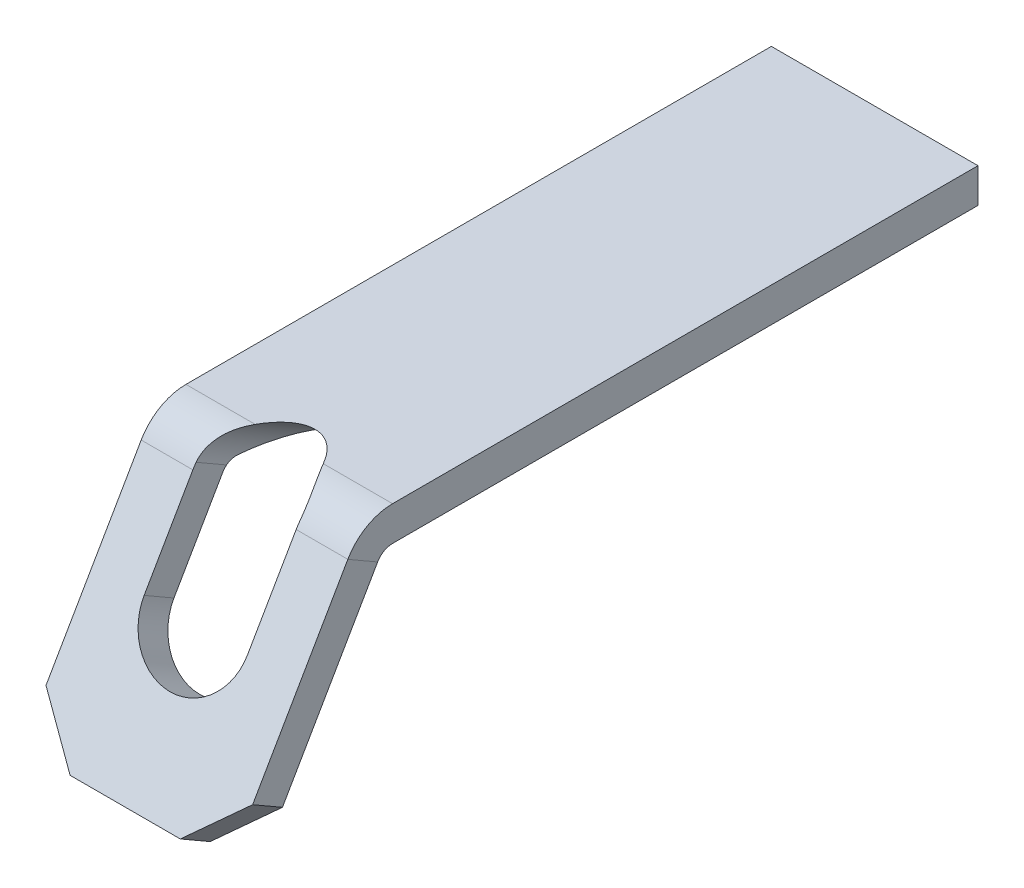
ISO-10303-21;
HEADER;
FILE_DESCRIPTION(('STEP AP214'),'2;1');
FILE_NAME('part.step','',(''),(''),'','','');
FILE_SCHEMA(('AUTOMOTIVE_DESIGN { 1 0 10303 214 1 1 1 1 }'));
ENDSEC;
DATA;
#1=APPLICATION_CONTEXT('core data for automotive mechanical design processes');
#2=APPLICATION_PROTOCOL_DEFINITION('international standard','automotive_design',2000,#1);
#3=PRODUCT_CONTEXT('',#1,'mechanical');
#4=PRODUCT('Part','Part','',(#3));
#5=PRODUCT_RELATED_PRODUCT_CATEGORY('part','',(#4));
#6=PRODUCT_DEFINITION_FORMATION('','',#4);
#7=PRODUCT_DEFINITION_CONTEXT('part definition',#1,'design');
#8=PRODUCT_DEFINITION('design','',#6,#7);
#9=PRODUCT_DEFINITION_SHAPE('','',#8);
#10=(LENGTH_UNIT() NAMED_UNIT(*) SI_UNIT(.MILLI.,.METRE.));
#11=(NAMED_UNIT(*) PLANE_ANGLE_UNIT() SI_UNIT($,.RADIAN.));
#12=(NAMED_UNIT(*) SI_UNIT($,.STERADIAN.) SOLID_ANGLE_UNIT());
#13=UNCERTAINTY_MEASURE_WITH_UNIT(LENGTH_MEASURE(1.E-05),#10,'distance_accuracy_value','');
#14=(GEOMETRIC_REPRESENTATION_CONTEXT(3) GLOBAL_UNCERTAINTY_ASSIGNED_CONTEXT((#13)) GLOBAL_UNIT_ASSIGNED_CONTEXT((#10,
#11,#12)) REPRESENTATION_CONTEXT('',''));
#15=CARTESIAN_POINT('',(0.,0.,0.));
#16=DIRECTION('',(0.,0.,1.));
#17=DIRECTION('',(1.,0.,0.));
#18=AXIS2_PLACEMENT_3D('',#15,#16,#17);
#19=CARTESIAN_POINT('',(0.,-0.5,4.25));
#20=DIRECTION('',(1.,0.,0.));
#21=DIRECTION('',(0.,0.,-1.));
#22=AXIS2_PLACEMENT_3D('',#19,#20,#21);
#23=CYLINDRICAL_SURFACE('',#22,0.25);
#24=CARTESIAN_POINT('',(0.738540154084688,-0.25,4.25));
#25=CARTESIAN_POINT('',(0.739796227190586,-0.249992222476748,4.26423192600012));
#26=CARTESIAN_POINT('',(0.741136393695474,-0.251215674942695,4.27845228618072));
#27=CARTESIAN_POINT('',(0.743704492818735,-0.255982139403662,4.30608304503192));
#28=CARTESIAN_POINT('',(0.74493454642555,-0.2594573169147,4.31950497559517));
#29=CARTESIAN_POINT('',(0.747172335123278,-0.268891956089954,4.34646595481917));
#30=CARTESIAN_POINT('',(0.748160348429003,-0.274998607282581,4.35995559261057));
#31=CARTESIAN_POINT('',(0.749588900459598,-0.289725386987503,4.38608332336731));
#32=CARTESIAN_POINT('',(0.750011148585141,-0.298418856822308,4.3986810266524));
#33=CARTESIAN_POINT('',(0.75,-0.308220009215909,4.41037591818866));
#34=B_SPLINE_CURVE_WITH_KNOTS('',3,(#24,#25,#26,#27,#28,#29,#30,#31,#32,#33),.UNSPECIFIED.,.F.,
.F.,(4,2,2,2,4),(0.,0.0428026914059938,0.0843723717900828,0.128652135829097,0.174331417159321),.UNSPECIFIED.);
#35=CARTESIAN_POINT('',(0.738540154084688,-0.25,4.25));
#36=VERTEX_POINT('',#35);
#37=CARTESIAN_POINT('',(0.75,-0.308220009215908,4.41037591818866));
#38=VERTEX_POINT('',#37);
#39=EDGE_CURVE('E319',#36,#38,#34,.T.);
#40=ORIENTED_EDGE('',*,*,#39,.F.);
#41=DIRECTION('',(1.,0.,0.));
#42=VECTOR('',#41,1.);
#43=CARTESIAN_POINT('',(-1.5,-0.25,4.25));
#44=LINE('',#43,#42);
#45=CARTESIAN_POINT('',(1.5,-0.25,4.25));
#46=VERTEX_POINT('',#45);
#47=EDGE_CURVE('E318',#36,#46,#44,.T.);
#48=ORIENTED_EDGE('',*,*,#47,.T.);
#49=CARTESIAN_POINT('',(1.5,-0.5,4.25));
#50=DIRECTION('',(1.,0.,0.));
#51=DIRECTION('',(0.,1.,0.));
#52=AXIS2_PLACEMENT_3D('',#49,#50,#51);
#53=CIRCLE('',#52,0.25);
#54=CARTESIAN_POINT('',(1.5,-0.375,4.46650635094611));
#55=VERTEX_POINT('',#54);
#56=EDGE_CURVE('E345',#46,#55,#53,.T.);
#57=ORIENTED_EDGE('',*,*,#56,.T.);
#58=DIRECTION('',(1.,0.,0.));
#59=VECTOR('',#58,1.);
#60=CARTESIAN_POINT('',(-1.5,-0.375,4.46650635094611));
#61=LINE('',#60,#59);
#62=CARTESIAN_POINT('',(0.75,-0.375,4.46650635094611));
#63=VERTEX_POINT('',#62);
#64=EDGE_CURVE('E334',#63,#55,#61,.T.);
#65=ORIENTED_EDGE('',*,*,#64,.F.);
#66=CARTESIAN_POINT('',(0.75,-0.5,4.25));
#67=DIRECTION('',(1.,0.,0.));
#68=DIRECTION('',(0.,0.,-1.));
#69=AXIS2_PLACEMENT_3D('',#66,#67,#68);
#70=CIRCLE('',#69,0.25);
#71=EDGE_CURVE('E205',#38,#63,#70,.T.);
#72=ORIENTED_EDGE('',*,*,#71,.F.);
#73=EDGE_LOOP('',(#40,#48,#57,#65,#72));
#74=FACE_BOUND('',#73,.T.);
#75=ADVANCED_FACE('F34',(#74),#23,.F.);
#76=CARTESIAN_POINT('',(0.,-0.5,4.25));
#77=DIRECTION('',(1.,0.,0.));
#78=DIRECTION('',(0.,0.,-1.));
#79=AXIS2_PLACEMENT_3D('',#76,#77,#78);
#80=CYLINDRICAL_SURFACE('',#79,0.75);
#81=CARTESIAN_POINT('',(0.75,-0.0530774463347981,4.85229580027208));
#82=CARTESIAN_POINT('',(0.750002475309161,-0.0390500007812527,4.84189012408484));
#83=CARTESIAN_POINT('',(0.749397484850658,-0.0253996458115997,4.83099771523583));
#84=CARTESIAN_POINT('',(0.747030547301498,0.00104006971930772,4.8083555069125));
#85=CARTESIAN_POINT('',(0.745269813605595,0.0138303177827564,4.79660661812892));
#86=CARTESIAN_POINT('',(0.738388136393959,0.0505308719127275,4.7604737016062));
#87=CARTESIAN_POINT('',(0.731665075692414,0.0730740166895009,4.73497676608455));
#88=CARTESIAN_POINT('',(0.714670479663492,0.113924752364809,4.68210224166803));
#89=CARTESIAN_POINT('',(0.704412929418581,0.132248568388786,4.65473240041221));
#90=CARTESIAN_POINT('',(0.681092480512217,0.164811508788652,4.59868326911695));
#91=CARTESIAN_POINT('',(0.668020265449992,0.179036692146175,4.56999988576025));
#92=CARTESIAN_POINT('',(0.63361768347433,0.2088635379017,4.49914580377907));
#93=CARTESIAN_POINT('',(0.611187373419911,0.222307050936848,4.45660414355653));
#94=CARTESIAN_POINT('',(0.564129396140941,0.241456718121171,4.37110856302409));
#95=CARTESIAN_POINT('',(0.539503361307708,0.247168570016325,4.3281549698181));
#96=CARTESIAN_POINT('',(0.508168812013807,0.249724148600028,4.27340370863223));
#97=CARTESIAN_POINT('',(0.501476538124168,0.249996949131605,4.26170462495713));
#98=CARTESIAN_POINT('',(0.494804752028709,0.250000000000006,4.25));
#99=B_SPLINE_CURVE_WITH_KNOTS('',3,(#81,#82,#83,#84,#85,#86,#87,#88,#89,#90,#91,#92,#93,#94,#95,
#96,#97,#98),.UNSPECIFIED.,.F.,.F.,(4,2,2,2,2,2,2,2,4),(0.,0.0523524240966635,0.104649972016483,
0.208128032232243,0.311201270134959,0.4146210689264,0.563636486235141,0.712542028697262,
0.752971410406567),.UNSPECIFIED.);
#100=CARTESIAN_POINT('',(0.75,-0.0530774463347985,4.85229580027207));
#101=VERTEX_POINT('',#100);
#102=CARTESIAN_POINT('',(0.494804752028707,0.25,4.25));
#103=VERTEX_POINT('',#102);
#104=EDGE_CURVE('E244',#101,#103,#99,.T.);
#105=ORIENTED_EDGE('',*,*,#104,.F.);
#106=CARTESIAN_POINT('',(0.75,-0.5,4.25));
#107=DIRECTION('',(1.,0.,0.));
#108=DIRECTION('',(0.,0.,-1.));
#109=AXIS2_PLACEMENT_3D('',#106,#107,#108);
#110=CIRCLE('',#109,0.75);
#111=CARTESIAN_POINT('',(0.75,-0.125000000000001,4.89951905283833));
#112=VERTEX_POINT('',#111);
#113=EDGE_CURVE('E207',#112,#101,#110,.F.);
#114=ORIENTED_EDGE('',*,*,#113,.F.);
#115=DIRECTION('',(-1.,0.,0.));
#116=VECTOR('',#115,1.);
#117=CARTESIAN_POINT('',(1.5,-0.125000000000001,4.89951905283833));
#118=LINE('',#117,#116);
#119=CARTESIAN_POINT('',(1.5,-0.125000000000001,4.89951905283833));
#120=VERTEX_POINT('',#119);
#121=EDGE_CURVE('E342',#120,#112,#118,.T.);
#122=ORIENTED_EDGE('',*,*,#121,.F.);
#123=CARTESIAN_POINT('',(1.5,-0.5,4.25));
#124=DIRECTION('',(1.,0.,0.));
#125=DIRECTION('',(0.,1.,0.));
#126=AXIS2_PLACEMENT_3D('',#123,#124,#125);
#127=CIRCLE('',#126,0.75);
#128=CARTESIAN_POINT('',(1.5,0.25,4.25));
#129=VERTEX_POINT('',#128);
#130=EDGE_CURVE('E356',#129,#120,#127,.T.);
#131=ORIENTED_EDGE('',*,*,#130,.F.);
#132=DIRECTION('',(1.,0.,0.));
#133=VECTOR('',#132,1.);
#134=CARTESIAN_POINT('',(-1.5,0.25,4.25));
#135=LINE('',#134,#133);
#136=EDGE_CURVE('E373',#103,#129,#135,.T.);
#137=ORIENTED_EDGE('',*,*,#136,.F.);
#138=EDGE_LOOP('',(#105,#114,#122,#131,#137));
#139=FACE_BOUND('',#138,.T.);
#140=ADVANCED_FACE('F258',(#139),#80,.T.);
#141=CARTESIAN_POINT('',(1.5,0.25,-4.25));
#142=DIRECTION('',(-1.,0.,0.));
#143=DIRECTION('',(0.,0.,1.));
#144=AXIS2_PLACEMENT_3D('',#141,#142,#143);
#145=PLANE('',#144);
#146=DIRECTION('',(0.,0.,-1.));
#147=VECTOR('',#146,1.);
#148=CARTESIAN_POINT('',(1.5,-0.25,-4.25));
#149=LINE('',#148,#147);
#150=CARTESIAN_POINT('',(1.5,-0.25,-4.25));
#151=VERTEX_POINT('',#150);
#152=EDGE_CURVE('E365',#46,#151,#149,.T.);
#153=ORIENTED_EDGE('',*,*,#152,.T.);
#154=DIRECTION('',(0.,-1.,0.));
#155=VECTOR('',#154,1.);
#156=CARTESIAN_POINT('',(1.5,0.25,-4.25));
#157=LINE('',#156,#155);
#158=CARTESIAN_POINT('',(1.5,0.25,-4.25));
#159=VERTEX_POINT('',#158);
#160=EDGE_CURVE('E183',#159,#151,#157,.T.);
#161=ORIENTED_EDGE('',*,*,#160,.F.);
#162=DIRECTION('',(0.,0.,-1.));
#163=VECTOR('',#162,1.);
#164=CARTESIAN_POINT('',(1.5,0.25,-4.25));
#165=LINE('',#164,#163);
#166=EDGE_CURVE('E366',#129,#159,#165,.T.);
#167=ORIENTED_EDGE('',*,*,#166,.F.);
#168=ORIENTED_EDGE('',*,*,#130,.T.);
#169=DIRECTION('',(0.,0.5,0.866025403784439));
#170=VECTOR('',#169,1.);
#171=CARTESIAN_POINT('',(1.5,-0.375,4.46650635094611));
#172=LINE('',#171,#170);
#173=EDGE_CURVE('E348',#55,#120,#172,.T.);
#174=ORIENTED_EDGE('',*,*,#173,.F.);
#175=ORIENTED_EDGE('',*,*,#56,.F.);
#176=EDGE_LOOP('',(#153,#161,#167,#168,#174,#175));
#177=FACE_BOUND('',#176,.T.);
#178=ADVANCED_FACE('F281',(#177),#145,.F.);
#179=CARTESIAN_POINT('',(-1.5,0.25,-4.25));
#180=DIRECTION('',(0.,0.,1.));
#181=DIRECTION('',(1.,0.,0.));
#182=AXIS2_PLACEMENT_3D('',#179,#180,#181);
#183=PLANE('',#182);
#184=DIRECTION('',(-1.,0.,0.));
#185=VECTOR('',#184,1.);
#186=CARTESIAN_POINT('',(-1.5,-0.25,-4.25));
#187=LINE('',#186,#185);
#188=CARTESIAN_POINT('',(-1.5,-0.25,-4.25));
#189=VERTEX_POINT('',#188);
#190=EDGE_CURVE('E380',#151,#189,#187,.T.);
#191=ORIENTED_EDGE('',*,*,#190,.T.);
#192=DIRECTION('',(0.,-1.,0.));
#193=VECTOR('',#192,1.);
#194=CARTESIAN_POINT('',(-1.5,0.25,-4.25));
#195=LINE('',#194,#193);
#196=CARTESIAN_POINT('',(-1.5,0.25,-4.25));
#197=VERTEX_POINT('',#196);
#198=EDGE_CURVE('E377',#197,#189,#195,.T.);
#199=ORIENTED_EDGE('',*,*,#198,.F.);
#200=DIRECTION('',(-1.,0.,0.));
#201=VECTOR('',#200,1.);
#202=CARTESIAN_POINT('',(-1.5,0.25,-4.25));
#203=LINE('',#202,#201);
#204=EDGE_CURVE('E369',#159,#197,#203,.T.);
#205=ORIENTED_EDGE('',*,*,#204,.F.);
#206=ORIENTED_EDGE('',*,*,#160,.T.);
#207=EDGE_LOOP('',(#191,#199,#205,#206));
#208=FACE_BOUND('',#207,.T.);
#209=ADVANCED_FACE('F277',(#208),#183,.F.);
#210=CARTESIAN_POINT('',(-1.5,0.25,-4.25));
#211=DIRECTION('',(1.,0.,0.));
#212=DIRECTION('',(0.,0.,-1.));
#213=AXIS2_PLACEMENT_3D('',#210,#211,#212);
#214=PLANE('',#213);
#215=DIRECTION('',(0.,0.,1.));
#216=VECTOR('',#215,1.);
#217=CARTESIAN_POINT('',(-1.5,-0.25,-4.25));
#218=LINE('',#217,#216);
#219=CARTESIAN_POINT('',(-1.5,-0.25,4.25));
#220=VERTEX_POINT('',#219);
#221=EDGE_CURVE('E382',#189,#220,#218,.T.);
#222=ORIENTED_EDGE('',*,*,#221,.T.);
#223=CARTESIAN_POINT('',(-1.5,-0.5,4.25));
#224=DIRECTION('',(1.,0.,0.));
#225=DIRECTION('',(0.,1.,0.));
#226=AXIS2_PLACEMENT_3D('',#223,#224,#225);
#227=CIRCLE('',#226,0.25);
#228=CARTESIAN_POINT('',(-1.5,-0.375,4.46650635094611));
#229=VERTEX_POINT('',#228);
#230=EDGE_CURVE('E332',#220,#229,#227,.T.);
#231=ORIENTED_EDGE('',*,*,#230,.T.);
#232=DIRECTION('',(0.,-0.5,-0.866025403784439));
#233=VECTOR('',#232,1.);
#234=CARTESIAN_POINT('',(-1.5,-0.125000000000001,4.89951905283833));
#235=LINE('',#234,#233);
#236=CARTESIAN_POINT('',(-1.5,-0.125000000000001,4.89951905283833));
#237=VERTEX_POINT('',#236);
#238=EDGE_CURVE('E323',#237,#229,#235,.T.);
#239=ORIENTED_EDGE('',*,*,#238,.F.);
#240=CARTESIAN_POINT('',(-1.5,-0.5,4.25));
#241=DIRECTION('',(1.,0.,0.));
#242=DIRECTION('',(0.,1.,0.));
#243=AXIS2_PLACEMENT_3D('',#240,#241,#242);
#244=CIRCLE('',#243,0.75);
#245=CARTESIAN_POINT('',(-1.5,0.25,4.25));
#246=VERTEX_POINT('',#245);
#247=EDGE_CURVE('E320',#246,#237,#244,.T.);
#248=ORIENTED_EDGE('',*,*,#247,.F.);
#249=DIRECTION('',(0.,0.,1.));
#250=VECTOR('',#249,1.);
#251=CARTESIAN_POINT('',(-1.5,0.25,-4.25));
#252=LINE('',#251,#250);
#253=EDGE_CURVE('E371',#197,#246,#252,.T.);
#254=ORIENTED_EDGE('',*,*,#253,.F.);
#255=ORIENTED_EDGE('',*,*,#198,.T.);
#256=EDGE_LOOP('',(#222,#231,#239,#248,#254,#255));
#257=FACE_BOUND('',#256,.T.);
#258=ADVANCED_FACE('F270',(#257),#214,.F.);
#259=CARTESIAN_POINT('',(0.,0.25,0.));
#260=DIRECTION('',(0.,1.,0.));
#261=DIRECTION('',(0.,0.,1.));
#262=AXIS2_PLACEMENT_3D('',#259,#260,#261);
#263=PLANE('',#262);
#264=CARTESIAN_POINT('',(0.,0.25,5.37724133595217));
#265=DIRECTION('',(0.,1.,0.));
#266=DIRECTION('',(0.,0.,1.));
#267=AXIS2_PLACEMENT_3D('',#264,#265,#266);
#268=ELLIPSE('',#267,1.5,0.75);
#269=CARTESIAN_POINT('',(-0.494804752028707,0.25,4.25));
#270=VERTEX_POINT('',#269);
#271=EDGE_CURVE('E209',#103,#270,#268,.T.);
#272=ORIENTED_EDGE('',*,*,#271,.F.);
#273=ORIENTED_EDGE('',*,*,#136,.T.);
#274=ORIENTED_EDGE('',*,*,#166,.T.);
#275=ORIENTED_EDGE('',*,*,#204,.T.);
#276=ORIENTED_EDGE('',*,*,#253,.T.);
#277=EDGE_CURVE('E374',#246,#270,#135,.T.);
#278=ORIENTED_EDGE('',*,*,#277,.T.);
#279=EDGE_LOOP('',(#272,#273,#274,#275,#276,#278));
#280=FACE_BOUND('',#279,.T.);
#281=ADVANCED_FACE('F267',(#280),#263,.T.);
#282=CARTESIAN_POINT('',(0.,-0.25,0.));
#283=DIRECTION('',(0.,1.,0.));
#284=DIRECTION('',(0.,0.,1.));
#285=AXIS2_PLACEMENT_3D('',#282,#283,#284);
#286=PLANE('',#285);
#287=ORIENTED_EDGE('',*,*,#47,.F.);
#288=CARTESIAN_POINT('',(0.,-0.25,4.51121593216774));
#289=DIRECTION('',(0.,1.,0.));
#290=DIRECTION('',(0.,0.,1.));
#291=AXIS2_PLACEMENT_3D('',#288,#289,#290);
#292=ELLIPSE('',#291,1.5,0.75);
#293=CARTESIAN_POINT('',(-0.738540154084688,-0.25,4.25));
#294=VERTEX_POINT('',#293);
#295=EDGE_CURVE('E219',#36,#294,#292,.T.);
#296=ORIENTED_EDGE('',*,*,#295,.T.);
#297=EDGE_CURVE('E311',#220,#294,#44,.T.);
#298=ORIENTED_EDGE('',*,*,#297,.F.);
#299=ORIENTED_EDGE('',*,*,#221,.F.);
#300=ORIENTED_EDGE('',*,*,#190,.F.);
#301=ORIENTED_EDGE('',*,*,#152,.F.);
#302=EDGE_LOOP('',(#287,#296,#298,#299,#300,#301));
#303=FACE_BOUND('',#302,.T.);
#304=ADVANCED_FACE('F263',(#303),#286,.F.);
#305=CARTESIAN_POINT('',(0.,-3.25,6.4150635094611));
#306=DIRECTION('',(0.,-0.866025403784438,0.500000000000001));
#307=DIRECTION('',(1.,0.,0.));
#308=AXIS2_PLACEMENT_3D('',#305,#306,#307);
#309=PLANE('',#308);
#310=DIRECTION('',(1.,0.,0.));
#311=VECTOR('',#310,1.);
#312=CARTESIAN_POINT('',(-1.5,-3.375,6.198557158515));
#313=LINE('',#312,#311);
#314=CARTESIAN_POINT('',(-0.799999999999998,-3.375,6.198557158515));
#315=VERTEX_POINT('',#314);
#316=CARTESIAN_POINT('',(0.8,-3.375,6.198557158515));
#317=VERTEX_POINT('',#316);
#318=EDGE_CURVE('E338',#315,#317,#313,.T.);
#319=ORIENTED_EDGE('',*,*,#318,.T.);
#320=DIRECTION('',(0.,0.500000000000001,0.866025403784438));
#321=VECTOR('',#320,1.);
#322=CARTESIAN_POINT('',(0.8,-3.25,6.4150635094611));
#323=LINE('',#322,#321);
#324=CARTESIAN_POINT('',(0.8,-3.125,6.63156986040721));
#325=VERTEX_POINT('',#324);
#326=EDGE_CURVE('E404',#317,#325,#323,.T.);
#327=ORIENTED_EDGE('',*,*,#326,.T.);
#328=DIRECTION('',(-1.,0.,0.));
#329=VECTOR('',#328,1.);
#330=CARTESIAN_POINT('',(1.5,-3.125,6.63156986040721));
#331=LINE('',#330,#329);
#332=CARTESIAN_POINT('',(-0.799999999999998,-3.125,6.63156986040721));
#333=VERTEX_POINT('',#332);
#334=EDGE_CURVE('E361',#325,#333,#331,.T.);
#335=ORIENTED_EDGE('',*,*,#334,.T.);
#336=DIRECTION('',(0.,-0.500000000000001,-0.866025403784438));
#337=VECTOR('',#336,1.);
#338=CARTESIAN_POINT('',(-0.799999999999998,-3.25,6.4150635094611));
#339=LINE('',#338,#337);
#340=EDGE_CURVE('E250',#333,#315,#339,.T.);
#341=ORIENTED_EDGE('',*,*,#340,.T.);
#342=EDGE_LOOP('',(#319,#327,#335,#341));
#343=FACE_BOUND('',#342,.T.);
#344=ADVANCED_FACE('F231',(#343),#309,.T.);
#345=CARTESIAN_POINT('',(-0.75,-0.308220009215908,4.41037591818866));
#346=CARTESIAN_POINT('',(-0.750008310530121,-0.299170345690206,4.39957110118343));
#347=CARTESIAN_POINT('',(-0.7496493719506,-0.291061551564701,4.38799997393136));
#348=CARTESIAN_POINT('',(-0.748415678099862,-0.277104423632904,4.36403100034418));
#349=CARTESIAN_POINT('',(-0.747555891577427,-0.271198332145317,4.35166604883466));
#350=CARTESIAN_POINT('',(-0.745421239101967,-0.261037124809497,4.32496342703673));
#351=CARTESIAN_POINT('',(-0.744115010283401,-0.256988760900442,4.31054949871758));
#352=CARTESIAN_POINT('',(-0.741355473168162,-0.25142101625551,4.28077071335262));
#353=CARTESIAN_POINT('',(-0.739898791250124,-0.249986913345264,4.26539018443887));
#354=CARTESIAN_POINT('',(-0.738540154084688,-0.25,4.25));
#355=B_SPLINE_CURVE_WITH_KNOTS('',3,(#345,#346,#347,#348,#349,#350,#351,#352,#353,#354),
.UNSPECIFIED.,.F.,.F.,(4,2,2,2,4),(0.,0.0422016336722642,0.0832023760305246,0.128047888733355,
0.174331752280167),.UNSPECIFIED.);
#356=CARTESIAN_POINT('',(-0.75,-0.308220009215908,4.41037591818866));
#357=VERTEX_POINT('',#356);
#358=EDGE_CURVE('E211',#357,#294,#355,.T.);
#359=ORIENTED_EDGE('',*,*,#358,.F.);
#360=CARTESIAN_POINT('',(-0.75,-0.5,4.25));
#361=DIRECTION('',(-1.,0.,0.));
#362=DIRECTION('',(0.,-1.,0.));
#363=AXIS2_PLACEMENT_3D('',#360,#361,#362);
#364=CIRCLE('',#363,0.25);
#365=CARTESIAN_POINT('',(-0.75,-0.375,4.46650635094611));
#366=VERTEX_POINT('',#365);
#367=EDGE_CURVE('E199',#366,#357,#364,.T.);
#368=ORIENTED_EDGE('',*,*,#367,.F.);
#369=EDGE_CURVE('E343',#229,#366,#61,.T.);
#370=ORIENTED_EDGE('',*,*,#369,.F.);
#371=ORIENTED_EDGE('',*,*,#230,.F.);
#372=ORIENTED_EDGE('',*,*,#297,.T.);
#373=EDGE_LOOP('',(#359,#368,#370,#371,#372));
#374=FACE_BOUND('',#373,.T.);
#375=ADVANCED_FACE('F221',(#374),#23,.F.);
#376=CARTESIAN_POINT('',(-0.494804752028707,0.25,4.25));
#377=CARTESIAN_POINT('',(-0.507212223849995,0.24999104936502,4.27176544478382));
#378=CARTESIAN_POINT('',(-0.519677329562981,0.249052174133644,4.29348153759597));
#379=CARTESIAN_POINT('',(-0.544476505895984,0.245273819176751,4.33686353730328));
#380=CARTESIAN_POINT('',(-0.556810364065535,0.242431628285439,4.35852932830796));
#381=CARTESIAN_POINT('',(-0.593492984985001,0.230897623169133,4.42397071088134));
#382=CARTESIAN_POINT('',(-0.617199549117097,0.219196023208876,4.46764754407431));
#383=CARTESIAN_POINT('',(-0.655369353049871,0.191156681794535,4.54326612847591));
#384=CARTESIAN_POINT('',(-0.670675057728904,0.176653514513336,4.57546468892482));
#385=CARTESIAN_POINT('',(-0.697958612412823,0.142647605295805,4.63828922937357));
#386=CARTESIAN_POINT('',(-0.70996212874235,0.123185827280292,4.66892573721418));
#387=CARTESIAN_POINT('',(-0.729340509733132,0.0800406667948656,4.72675752132392));
#388=CARTESIAN_POINT('',(-0.736878604418717,0.0565530386505959,4.75404068185705));
#389=CARTESIAN_POINT('',(-0.744635583122395,0.0179834450445735,4.79270929564723));
#390=CARTESIAN_POINT('',(-0.746630830911752,0.00444936512402553,4.80531366677174));
#391=CARTESIAN_POINT('',(-0.749315579530813,-0.0236048687245404,4.82956257178275));
#392=CARTESIAN_POINT('',(-0.750003338619623,-0.0381263113268377,4.84120580560175));
#393=CARTESIAN_POINT('',(-0.75,-0.0530774463347993,4.85229580027208));
#394=B_SPLINE_CURVE_WITH_KNOTS('',3,(#376,#377,#378,#379,#380,#381,#382,#383,#384,#385,#386,
#387,#388,#389,#390,#391,#392,#393),.UNSPECIFIED.,.F.,.F.,(4,2,2,2,2,2,2,2,4),(0.,
0.0751135104377852,0.150334244069228,0.302651785589941,0.417705443137115,0.531837811097346,
0.641489009411778,0.697207014432039,0.752999191038594),.UNSPECIFIED.);
#395=CARTESIAN_POINT('',(-0.75,-0.0530774463347985,4.85229580027207));
#396=VERTEX_POINT('',#395);
#397=EDGE_CURVE('E182',#270,#396,#394,.T.);
#398=ORIENTED_EDGE('',*,*,#397,.F.);
#399=ORIENTED_EDGE('',*,*,#277,.F.);
#400=ORIENTED_EDGE('',*,*,#247,.T.);
#401=CARTESIAN_POINT('',(-0.75,-0.125000000000001,4.89951905283833));
#402=VERTEX_POINT('',#401);
#403=EDGE_CURVE('E359',#402,#237,#118,.T.);
#404=ORIENTED_EDGE('',*,*,#403,.F.);
#405=CARTESIAN_POINT('',(-0.75,-0.5,4.25));
#406=DIRECTION('',(-1.,0.,0.));
#407=DIRECTION('',(0.,-1.,0.));
#408=AXIS2_PLACEMENT_3D('',#405,#406,#407);
#409=CIRCLE('',#408,0.75);
#410=EDGE_CURVE('E179',#396,#402,#409,.F.);
#411=ORIENTED_EDGE('',*,*,#410,.F.);
#412=EDGE_LOOP('',(#398,#399,#400,#404,#411));
#413=FACE_BOUND('',#412,.T.);
#414=ADVANCED_FACE('F252',(#413),#80,.T.);
#415=CARTESIAN_POINT('',(-1.5,-0.125,4.89951905283833));
#416=DIRECTION('',(-1.,0.,0.));
#417=DIRECTION('',(0.,0.,1.));
#418=AXIS2_PLACEMENT_3D('',#415,#416,#417);
#419=PLANE('',#418);
#420=DIRECTION('',(0.,-0.866025403784438,0.500000000000001));
#421=VECTOR('',#420,1.);
#422=CARTESIAN_POINT('',(-1.5,-0.375,4.46650635094611));
#423=LINE('',#422,#421);
#424=CARTESIAN_POINT('',(-1.5,-2.76878221735089,5.84855715851499));
#425=VERTEX_POINT('',#424);
#426=EDGE_CURVE('E336',#229,#425,#423,.T.);
#427=ORIENTED_EDGE('',*,*,#426,.T.);
#428=DIRECTION('',(0.,0.500000000000001,0.866025403784438));
#429=VECTOR('',#428,1.);
#430=CARTESIAN_POINT('',(-1.5,-2.51878221735089,6.28156986040721));
#431=LINE('',#430,#429);
#432=CARTESIAN_POINT('',(-1.5,-2.51878221735089,6.28156986040721));
#433=VERTEX_POINT('',#432);
#434=EDGE_CURVE('E11',#425,#433,#431,.T.);
#435=ORIENTED_EDGE('',*,*,#434,.T.);
#436=DIRECTION('',(0.,-0.866025403784438,0.500000000000001));
#437=VECTOR('',#436,1.);
#438=CARTESIAN_POINT('',(-1.5,-0.125,4.89951905283833));
#439=LINE('',#438,#437);
#440=EDGE_CURVE('E339',#237,#433,#439,.T.);
#441=ORIENTED_EDGE('',*,*,#440,.F.);
#442=ORIENTED_EDGE('',*,*,#238,.T.);
#443=EDGE_LOOP('',(#427,#435,#441,#442));
#444=FACE_BOUND('',#443,.T.);
#445=ADVANCED_FACE('F233',(#444),#419,.T.);
#446=CARTESIAN_POINT('',(-1.5,-0.375,4.46650635094611));
#447=DIRECTION('',(0.,-0.500000000000001,-0.866025403784438));
#448=DIRECTION('',(0.,0.866025403784438,-0.500000000000001));
#449=AXIS2_PLACEMENT_3D('',#446,#447,#448);
#450=PLANE('',#449);
#451=DIRECTION('',(0.,-0.866025403784438,0.500000000000001));
#452=VECTOR('',#451,1.);
#453=CARTESIAN_POINT('',(1.5,-0.375,4.46650635094611));
#454=LINE('',#453,#452);
#455=CARTESIAN_POINT('',(1.5,-2.76878221735089,5.84855715851499));
#456=VERTEX_POINT('',#455);
#457=EDGE_CURVE('E351',#55,#456,#454,.T.);
#458=ORIENTED_EDGE('',*,*,#457,.T.);
#459=DIRECTION('',(0.707106781186546,0.612372435695796,-0.353553390593275));
#460=VECTOR('',#459,1.);
#461=CARTESIAN_POINT('',(1.38205080756888,-2.8709292143521,5.90753175473055));
#462=LINE('',#461,#460);
#463=EDGE_CURVE('E42',#456,#317,#462,.F.);
#464=ORIENTED_EDGE('',*,*,#463,.T.);
#465=ORIENTED_EDGE('',*,*,#318,.F.);
#466=DIRECTION('',(0.707106781186546,-0.612372435695796,0.353553390593275));
#467=VECTOR('',#466,1.);
#468=CARTESIAN_POINT('',(-2.88205080756888,-1.57189110867544,5.15753175473055));
#469=LINE('',#468,#467);
#470=EDGE_CURVE('E49',#315,#425,#469,.F.);
#471=ORIENTED_EDGE('',*,*,#470,.T.);
#472=ORIENTED_EDGE('',*,*,#426,.F.);
#473=ORIENTED_EDGE('',*,*,#369,.T.);
#474=DIRECTION('',(0.,0.866025403784438,-0.500000000000001));
#475=VECTOR('',#474,1.);
#476=CARTESIAN_POINT('',(-0.75,-0.375,4.46650635094611));
#477=LINE('',#476,#475);
#478=CARTESIAN_POINT('',(-0.75,-1.5996479222419,5.17355715851499));
#479=VERTEX_POINT('',#478);
#480=EDGE_CURVE('E195',#479,#366,#477,.T.);
#481=ORIENTED_EDGE('',*,*,#480,.F.);
#482=CARTESIAN_POINT('',(0.,-1.5996479222419,5.17355715851499));
#483=DIRECTION('',(0.,-0.500000000000001,-0.866025403784438));
#484=DIRECTION('',(0.,0.866025403784438,-0.500000000000001));
#485=AXIS2_PLACEMENT_3D('',#482,#483,#484);
#486=CIRCLE('',#485,0.75);
#487=CARTESIAN_POINT('',(0.75,-1.5996479222419,5.17355715851499));
#488=VERTEX_POINT('',#487);
#489=EDGE_CURVE('E168',#488,#479,#486,.T.);
#490=ORIENTED_EDGE('',*,*,#489,.F.);
#491=DIRECTION('',(0.,-0.866025403784438,0.500000000000001));
#492=VECTOR('',#491,1.);
#493=CARTESIAN_POINT('',(0.75,-0.375,4.46650635094611));
#494=LINE('',#493,#492);
#495=EDGE_CURVE('E203',#63,#488,#494,.T.);
#496=ORIENTED_EDGE('',*,*,#495,.F.);
#497=ORIENTED_EDGE('',*,*,#64,.T.);
#498=EDGE_LOOP('',(#458,#464,#465,#471,#472,#473,#481,#490,#496,#497));
#499=FACE_BOUND('',#498,.T.);
#500=ADVANCED_FACE('F395',(#499),#450,.T.);
#501=CARTESIAN_POINT('',(1.5,-0.375,4.46650635094611));
#502=DIRECTION('',(1.,0.,0.));
#503=DIRECTION('',(0.,0.,-1.));
#504=AXIS2_PLACEMENT_3D('',#501,#502,#503);
#505=PLANE('',#504);
#506=DIRECTION('',(0.,-0.866025403784438,0.500000000000001));
#507=VECTOR('',#506,1.);
#508=CARTESIAN_POINT('',(1.5,-0.125,4.89951905283833));
#509=LINE('',#508,#507);
#510=CARTESIAN_POINT('',(1.5,-2.51878221735089,6.28156986040721));
#511=VERTEX_POINT('',#510);
#512=EDGE_CURVE('E353',#120,#511,#509,.T.);
#513=ORIENTED_EDGE('',*,*,#512,.T.);
#514=DIRECTION('',(0.,-0.500000000000001,-0.866025403784438));
#515=VECTOR('',#514,1.);
#516=CARTESIAN_POINT('',(1.5,-2.76878221735089,5.84855715851499));
#517=LINE('',#516,#515);
#518=EDGE_CURVE('E57',#511,#456,#517,.T.);
#519=ORIENTED_EDGE('',*,*,#518,.T.);
#520=ORIENTED_EDGE('',*,*,#457,.F.);
#521=ORIENTED_EDGE('',*,*,#173,.T.);
#522=EDGE_LOOP('',(#513,#519,#520,#521));
#523=FACE_BOUND('',#522,.T.);
#524=ADVANCED_FACE('F259',(#523),#505,.T.);
#525=CARTESIAN_POINT('',(1.5,-0.125,4.89951905283833));
#526=DIRECTION('',(0.,0.500000000000001,0.866025403784438));
#527=DIRECTION('',(0.,-0.866025403784438,0.500000000000001));
#528=AXIS2_PLACEMENT_3D('',#525,#526,#527);
#529=PLANE('',#528);
#530=ORIENTED_EDGE('',*,*,#334,.F.);
#531=DIRECTION('',(-0.707106781186546,-0.612372435695796,0.353553390593275));
#532=VECTOR('',#531,1.);
#533=CARTESIAN_POINT('',(2.88205080756888,-1.32189110867544,5.59054445662277));
#534=LINE('',#533,#532);
#535=EDGE_CURVE('E403',#325,#511,#534,.F.);
#536=ORIENTED_EDGE('',*,*,#535,.T.);
#537=ORIENTED_EDGE('',*,*,#512,.F.);
#538=ORIENTED_EDGE('',*,*,#121,.T.);
#539=DIRECTION('',(0.,0.866025403784438,-0.500000000000001));
#540=VECTOR('',#539,1.);
#541=CARTESIAN_POINT('',(0.75,-0.0506098165652452,4.85656986040721));
#542=LINE('',#541,#540);
#543=CARTESIAN_POINT('',(0.75,-1.3496479222419,5.60656986040721));
#544=VERTEX_POINT('',#543);
#545=EDGE_CURVE('E188',#544,#112,#542,.T.);
#546=ORIENTED_EDGE('',*,*,#545,.F.);
#547=CARTESIAN_POINT('',(0.,-1.3496479222419,5.60656986040721));
#548=DIRECTION('',(0.,0.500000000000001,0.866025403784438));
#549=DIRECTION('',(0.,-0.866025403784438,0.500000000000001));
#550=AXIS2_PLACEMENT_3D('',#547,#548,#549);
#551=CIRCLE('',#550,0.75);
#552=CARTESIAN_POINT('',(-0.75,-1.3496479222419,5.60656986040721));
#553=VERTEX_POINT('',#552);
#554=EDGE_CURVE('E165',#553,#544,#551,.T.);
#555=ORIENTED_EDGE('',*,*,#554,.F.);
#556=DIRECTION('',(0.,-0.866025403784438,0.500000000000001));
#557=VECTOR('',#556,1.);
#558=CARTESIAN_POINT('',(-0.75,-0.125,4.89951905283833));
#559=LINE('',#558,#557);
#560=EDGE_CURVE('E175',#402,#553,#559,.T.);
#561=ORIENTED_EDGE('',*,*,#560,.F.);
#562=ORIENTED_EDGE('',*,*,#403,.T.);
#563=ORIENTED_EDGE('',*,*,#440,.T.);
#564=DIRECTION('',(-0.707106781186546,0.612372435695796,-0.353553390593275));
#565=VECTOR('',#564,1.);
#566=CARTESIAN_POINT('',(-1.38205080756888,-2.6209292143521,6.34054445662277));
#567=LINE('',#566,#565);
#568=EDGE_CURVE('E402',#433,#333,#567,.F.);
#569=ORIENTED_EDGE('',*,*,#568,.T.);
#570=EDGE_LOOP('',(#530,#536,#537,#538,#546,#555,#561,#562,#563,#569));
#571=FACE_BOUND('',#570,.T.);
#572=ADVANCED_FACE('F186',(#571),#529,.T.);
#573=CARTESIAN_POINT('',(0.,-4.82496778264912,-3.41286071037125));
#574=DIRECTION('',(0.,0.500000000000001,0.866025403784438));
#575=DIRECTION('',(0.,-0.866025403784438,0.500000000000001));
#576=AXIS2_PLACEMENT_3D('',#573,#574,#575);
#577=CYLINDRICAL_SURFACE('',#576,0.75);
#578=ORIENTED_EDGE('',*,*,#39,.T.);
#579=DIRECTION('',(0.,0.500000000000001,0.866025403784438));
#580=VECTOR('',#579,1.);
#581=CARTESIAN_POINT('',(0.75,-4.82496778264912,-3.41286071037125));
#582=LINE('',#581,#580);
#583=EDGE_CURVE('E192',#38,#101,#582,.T.);
#584=ORIENTED_EDGE('',*,*,#583,.T.);
#585=ORIENTED_EDGE('',*,*,#104,.T.);
#586=ORIENTED_EDGE('',*,*,#271,.T.);
#587=ORIENTED_EDGE('',*,*,#397,.T.);
#588=DIRECTION('',(0.,0.500000000000001,0.866025403784438));
#589=VECTOR('',#588,1.);
#590=CARTESIAN_POINT('',(-0.75,-4.82496778264912,-3.41286071037125));
#591=LINE('',#590,#589);
#592=EDGE_CURVE('E172',#357,#396,#591,.T.);
#593=ORIENTED_EDGE('',*,*,#592,.F.);
#594=ORIENTED_EDGE('',*,*,#358,.T.);
#595=ORIENTED_EDGE('',*,*,#295,.F.);
#596=EDGE_LOOP('',(#578,#584,#585,#586,#587,#593,#594,#595));
#597=FACE_BOUND('',#596,.T.);
#598=ADVANCED_FACE('F225',(#597),#577,.F.);
#599=CARTESIAN_POINT('',(0.75,-4.82496778264912,-3.41286071037125));
#600=DIRECTION('',(1.,0.,0.));
#601=DIRECTION('',(0.,0.,-1.));
#602=AXIS2_PLACEMENT_3D('',#599,#600,#601);
#603=PLANE('',#602);
#604=ORIENTED_EDGE('',*,*,#113,.T.);
#605=ORIENTED_EDGE('',*,*,#583,.F.);
#606=ORIENTED_EDGE('',*,*,#71,.T.);
#607=ORIENTED_EDGE('',*,*,#495,.T.);
#608=DIRECTION('',(0.,0.500000000000001,0.866025403784438));
#609=VECTOR('',#608,1.);
#610=CARTESIAN_POINT('',(0.75,-6.12400588832578,-2.66286071037124));
#611=LINE('',#610,#609);
#612=EDGE_CURVE('E171',#488,#544,#611,.T.);
#613=ORIENTED_EDGE('',*,*,#612,.T.);
#614=ORIENTED_EDGE('',*,*,#545,.T.);
#615=EDGE_LOOP('',(#604,#605,#606,#607,#613,#614));
#616=FACE_BOUND('',#615,.T.);
#617=ADVANCED_FACE('F229',(#616),#603,.F.);
#618=CARTESIAN_POINT('',(0.,-6.12400588832578,-2.66286071037124));
#619=DIRECTION('',(0.,0.500000000000001,0.866025403784438));
#620=DIRECTION('',(0.,-0.866025403784438,0.500000000000001));
#621=AXIS2_PLACEMENT_3D('',#618,#619,#620);
#622=CYLINDRICAL_SURFACE('',#621,0.75);
#623=ORIENTED_EDGE('',*,*,#489,.T.);
#624=DIRECTION('',(0.,0.500000000000001,0.866025403784438));
#625=VECTOR('',#624,1.);
#626=CARTESIAN_POINT('',(-0.75,-6.12400588832578,-2.66286071037124));
#627=LINE('',#626,#625);
#628=EDGE_CURVE('E160',#479,#553,#627,.T.);
#629=ORIENTED_EDGE('',*,*,#628,.T.);
#630=ORIENTED_EDGE('',*,*,#554,.T.);
#631=ORIENTED_EDGE('',*,*,#612,.F.);
#632=EDGE_LOOP('',(#623,#629,#630,#631));
#633=FACE_BOUND('',#632,.T.);
#634=ADVANCED_FACE('F162',(#633),#622,.F.);
#635=CARTESIAN_POINT('',(-0.75,-4.82496778264912,-3.41286071037125));
#636=DIRECTION('',(-1.,0.,0.));
#637=DIRECTION('',(0.,-1.,0.));
#638=AXIS2_PLACEMENT_3D('',#635,#636,#637);
#639=PLANE('',#638);
#640=ORIENTED_EDGE('',*,*,#410,.T.);
#641=ORIENTED_EDGE('',*,*,#560,.T.);
#642=ORIENTED_EDGE('',*,*,#628,.F.);
#643=ORIENTED_EDGE('',*,*,#480,.T.);
#644=ORIENTED_EDGE('',*,*,#367,.T.);
#645=ORIENTED_EDGE('',*,*,#592,.T.);
#646=EDGE_LOOP('',(#640,#641,#642,#643,#644,#645));
#647=FACE_BOUND('',#646,.T.);
#648=ADVANCED_FACE('F176',(#647),#639,.F.);
#649=CARTESIAN_POINT('',(0.8,-3.25,6.4150635094611));
#650=DIRECTION('',(-0.707106781186549,0.612372435695793,-0.353553390593274));
#651=DIRECTION('',(0.,0.500000000000001,0.866025403784438));
#652=AXIS2_PLACEMENT_3D('',#649,#650,#651);
#653=PLANE('',#652);
#654=ORIENTED_EDGE('',*,*,#463,.F.);
#655=ORIENTED_EDGE('',*,*,#518,.F.);
#656=ORIENTED_EDGE('',*,*,#535,.F.);
#657=ORIENTED_EDGE('',*,*,#326,.F.);
#658=EDGE_LOOP('',(#654,#655,#656,#657));
#659=FACE_BOUND('',#658,.T.);
#660=ADVANCED_FACE('F285',(#659),#653,.F.);
#661=CARTESIAN_POINT('',(-0.799999999999998,-3.25,6.4150635094611));
#662=DIRECTION('',(0.707106781186549,0.612372435695792,-0.353553390593274));
#663=DIRECTION('',(0.,-0.500000000000001,-0.866025403784438));
#664=AXIS2_PLACEMENT_3D('',#661,#662,#663);
#665=PLANE('',#664);
#666=ORIENTED_EDGE('',*,*,#568,.F.);
#667=ORIENTED_EDGE('',*,*,#434,.F.);
#668=ORIENTED_EDGE('',*,*,#470,.F.);
#669=ORIENTED_EDGE('',*,*,#340,.F.);
#670=EDGE_LOOP('',(#666,#667,#668,#669));
#671=FACE_BOUND('',#670,.T.);
#672=ADVANCED_FACE('F36',(#671),#665,.F.);
#673=CLOSED_SHELL('',(#75,#140,#178,#209,#258,#281,#304,#344,#375,#414,#445,#500,#524,#572,#598,
#617,#634,#648,#660,#672));
#674=MANIFOLD_SOLID_BREP('B2',#673);
#675=ADVANCED_BREP_SHAPE_REPRESENTATION('',(#18,#674),#14);
#676=SHAPE_DEFINITION_REPRESENTATION(#9,#675);
ENDSEC;
END-ISO-10303-21;
